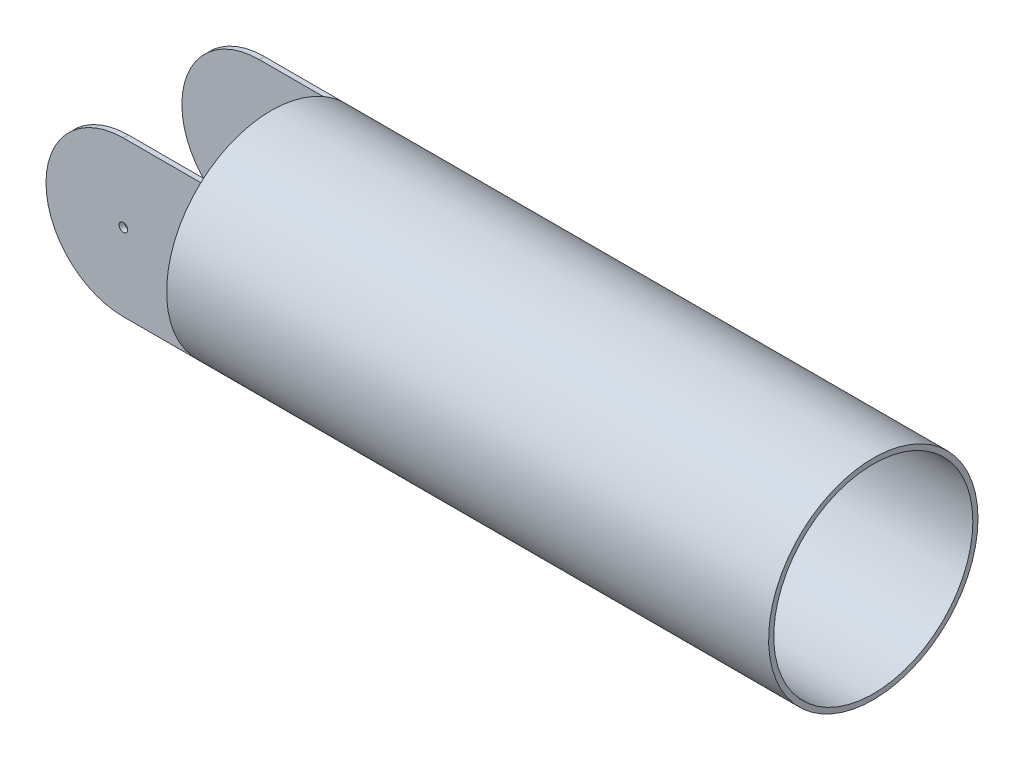
ISO-10303-21;
HEADER;
FILE_DESCRIPTION(('STEP AP214'),'2;1');
FILE_NAME('part.step','',(''),(''),'','','');
FILE_SCHEMA(('AUTOMOTIVE_DESIGN { 1 0 10303 214 1 1 1 1 }'));
ENDSEC;
DATA;
#1=APPLICATION_CONTEXT('core data for automotive mechanical design processes');
#2=APPLICATION_PROTOCOL_DEFINITION('international standard','automotive_design',2000,#1);
#3=PRODUCT_CONTEXT('',#1,'mechanical');
#4=PRODUCT('Part','Part','',(#3));
#5=PRODUCT_RELATED_PRODUCT_CATEGORY('part','',(#4));
#6=PRODUCT_DEFINITION_FORMATION('','',#4);
#7=PRODUCT_DEFINITION_CONTEXT('part definition',#1,'design');
#8=PRODUCT_DEFINITION('design','',#6,#7);
#9=PRODUCT_DEFINITION_SHAPE('','',#8);
#10=(LENGTH_UNIT() NAMED_UNIT(*) SI_UNIT(.MILLI.,.METRE.));
#11=(NAMED_UNIT(*) PLANE_ANGLE_UNIT() SI_UNIT($,.RADIAN.));
#12=(NAMED_UNIT(*) SI_UNIT($,.STERADIAN.) SOLID_ANGLE_UNIT());
#13=UNCERTAINTY_MEASURE_WITH_UNIT(LENGTH_MEASURE(1.E-05),#10,'distance_accuracy_value','');
#14=(GEOMETRIC_REPRESENTATION_CONTEXT(3) GLOBAL_UNCERTAINTY_ASSIGNED_CONTEXT((#13)) GLOBAL_UNIT_ASSIGNED_CONTEXT((#10,
#11,#12)) REPRESENTATION_CONTEXT('',''));
#15=CARTESIAN_POINT('',(0.,0.,0.));
#16=DIRECTION('',(0.,0.,1.));
#17=DIRECTION('',(1.,0.,0.));
#18=AXIS2_PLACEMENT_3D('',#15,#16,#17);
#19=CARTESIAN_POINT('',(0.,0.,164.));
#20=DIRECTION('',(0.,1.,0.));
#21=DIRECTION('',(0.,0.,1.));
#22=AXIS2_PLACEMENT_3D('',#19,#20,#21);
#23=PLANE('',#22);
#24=DIRECTION('',(0.,0.,1.));
#25=VECTOR('',#24,1.);
#26=CARTESIAN_POINT('',(90.,0.,-536.));
#27=LINE('',#26,#25);
#28=CARTESIAN_POINT('',(90.,0.,158.));
#29=VERTEX_POINT('',#28);
#30=CARTESIAN_POINT('',(90.,0.,164.));
#31=VERTEX_POINT('',#30);
#32=EDGE_CURVE('E136',#29,#31,#27,.T.);
#33=ORIENTED_EDGE('',*,*,#32,.F.);
#34=DIRECTION('',(1.,0.,0.));
#35=VECTOR('',#34,1.);
#36=CARTESIAN_POINT('',(0.,0.,158.));
#37=LINE('',#36,#35);
#38=CARTESIAN_POINT('',(180.,0.,158.));
#39=VERTEX_POINT('',#38);
#40=EDGE_CURVE('E144',#29,#39,#37,.T.);
#41=ORIENTED_EDGE('',*,*,#40,.T.);
#42=DIRECTION('',(0.,0.,-1.));
#43=VECTOR('',#42,1.);
#44=CARTESIAN_POINT('',(180.,0.,164.));
#45=LINE('',#44,#43);
#46=CARTESIAN_POINT('',(180.,0.,164.));
#47=VERTEX_POINT('',#46);
#48=EDGE_CURVE('E131',#47,#39,#45,.T.);
#49=ORIENTED_EDGE('',*,*,#48,.F.);
#50=DIRECTION('',(1.,0.,0.));
#51=VECTOR('',#50,1.);
#52=CARTESIAN_POINT('',(0.,0.,164.));
#53=LINE('',#52,#51);
#54=EDGE_CURVE('E152',#31,#47,#53,.T.);
#55=ORIENTED_EDGE('',*,*,#54,.F.);
#56=EDGE_LOOP('',(#33,#41,#49,#55));
#57=FACE_BOUND('',#56,.T.);
#58=ADVANCED_FACE('F33',(#57),#23,.F.);
#59=CARTESIAN_POINT('',(0.,180.,164.));
#60=DIRECTION('',(0.,-1.,0.));
#61=DIRECTION('',(0.,0.,-1.));
#62=AXIS2_PLACEMENT_3D('',#59,#60,#61);
#63=PLANE('',#62);
#64=DIRECTION('',(0.,0.,-1.));
#65=VECTOR('',#64,1.);
#66=CARTESIAN_POINT('',(180.,180.,164.));
#67=LINE('',#66,#65);
#68=CARTESIAN_POINT('',(180.,180.,164.));
#69=VERTEX_POINT('',#68);
#70=CARTESIAN_POINT('',(180.,180.,158.));
#71=VERTEX_POINT('',#70);
#72=EDGE_CURVE('E119',#69,#71,#67,.T.);
#73=ORIENTED_EDGE('',*,*,#72,.T.);
#74=DIRECTION('',(1.,0.,0.));
#75=VECTOR('',#74,1.);
#76=CARTESIAN_POINT('',(180.,180.,158.));
#77=LINE('',#76,#75);
#78=CARTESIAN_POINT('',(90.,180.,158.));
#79=VERTEX_POINT('',#78);
#80=EDGE_CURVE('E105',#79,#71,#77,.T.);
#81=ORIENTED_EDGE('',*,*,#80,.F.);
#82=DIRECTION('',(0.,0.,1.));
#83=VECTOR('',#82,1.);
#84=CARTESIAN_POINT('',(90.,180.,-536.));
#85=LINE('',#84,#83);
#86=CARTESIAN_POINT('',(90.,180.,164.));
#87=VERTEX_POINT('',#86);
#88=EDGE_CURVE('E168',#79,#87,#85,.T.);
#89=ORIENTED_EDGE('',*,*,#88,.T.);
#90=DIRECTION('',(-1.,0.,0.));
#91=VECTOR('',#90,1.);
#92=CARTESIAN_POINT('',(0.,180.,164.));
#93=LINE('',#92,#91);
#94=EDGE_CURVE('E120',#69,#87,#93,.T.);
#95=ORIENTED_EDGE('',*,*,#94,.F.);
#96=EDGE_LOOP('',(#73,#81,#89,#95));
#97=FACE_BOUND('',#96,.T.);
#98=ADVANCED_FACE('F225',(#97),#63,.F.);
#99=CARTESIAN_POINT('',(90.,90.,-536.));
#100=DIRECTION('',(0.,0.,1.));
#101=DIRECTION('',(1.,0.,0.));
#102=AXIS2_PLACEMENT_3D('',#99,#100,#101);
#103=CYLINDRICAL_SURFACE('',#102,90.);
#104=CARTESIAN_POINT('',(90.,90.,158.));
#105=DIRECTION('',(0.,0.,1.));
#106=DIRECTION('',(1.,0.,0.));
#107=AXIS2_PLACEMENT_3D('',#104,#105,#106);
#108=CIRCLE('',#107,90.);
#109=EDGE_CURVE('E11',#29,#79,#108,.F.);
#110=ORIENTED_EDGE('',*,*,#109,.F.);
#111=ORIENTED_EDGE('',*,*,#32,.T.);
#112=CARTESIAN_POINT('',(90.,90.,164.));
#113=DIRECTION('',(0.,0.,1.));
#114=DIRECTION('',(1.,0.,0.));
#115=AXIS2_PLACEMENT_3D('',#112,#113,#114);
#116=CIRCLE('',#115,90.);
#117=EDGE_CURVE('E169',#87,#31,#116,.T.);
#118=ORIENTED_EDGE('',*,*,#117,.F.);
#119=ORIENTED_EDGE('',*,*,#88,.F.);
#120=EDGE_LOOP('',(#110,#111,#118,#119));
#121=FACE_BOUND('',#120,.T.);
#122=ADVANCED_FACE('F230',(#121),#103,.T.);
#123=CARTESIAN_POINT('',(0.,0.,164.));
#124=DIRECTION('',(0.,0.,-1.));
#125=DIRECTION('',(-1.,0.,0.));
#126=AXIS2_PLACEMENT_3D('',#123,#124,#125);
#127=PLANE('',#126);
#128=CARTESIAN_POINT('',(90.,90.,164.));
#129=DIRECTION('',(0.,0.,1.));
#130=DIRECTION('',(1.,0.,0.));
#131=AXIS2_PLACEMENT_3D('',#128,#129,#130);
#132=CIRCLE('',#131,5.00000000000001);
#133=CARTESIAN_POINT('',(95.,90.,164.));
#134=VERTEX_POINT('',#133);
#135=EDGE_CURVE('E182',#134,#134,#132,.T.);
#136=ORIENTED_EDGE('',*,*,#135,.F.);
#137=EDGE_LOOP('',(#136));
#138=FACE_BOUND('',#137,.T.);
#139=ORIENTED_EDGE('',*,*,#117,.T.);
#140=ORIENTED_EDGE('',*,*,#54,.T.);
#141=DIRECTION('',(0.,1.,0.));
#142=VECTOR('',#141,1.);
#143=CARTESIAN_POINT('',(180.,0.,164.));
#144=LINE('',#143,#142);
#145=EDGE_CURVE('E125',#47,#69,#144,.T.);
#146=ORIENTED_EDGE('',*,*,#145,.T.);
#147=ORIENTED_EDGE('',*,*,#94,.T.);
#148=EDGE_LOOP('',(#139,#140,#146,#147));
#149=FACE_BOUND('',#148,.T.);
#150=ADVANCED_FACE('F238',(#138,#149),#127,.F.);
#151=CARTESIAN_POINT('',(0.,0.,0.));
#152=DIRECTION('',(0.,0.,-1.));
#153=DIRECTION('',(-1.,0.,0.));
#154=AXIS2_PLACEMENT_3D('',#151,#152,#153);
#155=PLANE('',#154);
#156=CARTESIAN_POINT('',(90.,90.,0.));
#157=DIRECTION('',(0.,0.,-1.));
#158=DIRECTION('',(-1.,0.,0.));
#159=AXIS2_PLACEMENT_3D('',#156,#157,#158);
#160=CIRCLE('',#159,5.00000000000001);
#161=CARTESIAN_POINT('',(85.,90.,0.));
#162=VERTEX_POINT('',#161);
#163=EDGE_CURVE('E112',#162,#162,#160,.T.);
#164=ORIENTED_EDGE('',*,*,#163,.F.);
#165=EDGE_LOOP('',(#164));
#166=FACE_BOUND('',#165,.T.);
#167=DIRECTION('',(1.,0.,0.));
#168=VECTOR('',#167,1.);
#169=CARTESIAN_POINT('',(0.,0.,0.));
#170=LINE('',#169,#168);
#171=CARTESIAN_POINT('',(90.,0.,0.));
#172=VERTEX_POINT('',#171);
#173=CARTESIAN_POINT('',(180.,0.,0.));
#174=VERTEX_POINT('',#173);
#175=EDGE_CURVE('E151',#172,#174,#170,.T.);
#176=ORIENTED_EDGE('',*,*,#175,.F.);
#177=CARTESIAN_POINT('',(90.,90.,0.));
#178=DIRECTION('',(0.,0.,-1.));
#179=DIRECTION('',(-1.,0.,0.));
#180=AXIS2_PLACEMENT_3D('',#177,#178,#179);
#181=CIRCLE('',#180,90.);
#182=CARTESIAN_POINT('',(90.,180.,0.));
#183=VERTEX_POINT('',#182);
#184=EDGE_CURVE('E134',#172,#183,#181,.T.);
#185=ORIENTED_EDGE('',*,*,#184,.T.);
#186=DIRECTION('',(-1.,0.,0.));
#187=VECTOR('',#186,1.);
#188=CARTESIAN_POINT('',(0.,180.,0.));
#189=LINE('',#188,#187);
#190=CARTESIAN_POINT('',(180.,180.,0.));
#191=VERTEX_POINT('',#190);
#192=EDGE_CURVE('E129',#191,#183,#189,.T.);
#193=ORIENTED_EDGE('',*,*,#192,.F.);
#194=DIRECTION('',(0.,1.,0.));
#195=VECTOR('',#194,1.);
#196=CARTESIAN_POINT('',(180.,0.,0.));
#197=LINE('',#196,#195);
#198=EDGE_CURVE('E153',#174,#191,#197,.T.);
#199=ORIENTED_EDGE('',*,*,#198,.F.);
#200=EDGE_LOOP('',(#176,#185,#193,#199));
#201=FACE_BOUND('',#200,.T.);
#202=ADVANCED_FACE('F148',(#166,#201),#155,.T.);
#203=CARTESIAN_POINT('',(180.,0.,6.));
#204=VERTEX_POINT('',#203);
#205=EDGE_CURVE('E123',#204,#174,#45,.T.);
#206=ORIENTED_EDGE('',*,*,#205,.F.);
#207=DIRECTION('',(-1.,0.,0.));
#208=VECTOR('',#207,1.);
#209=CARTESIAN_POINT('',(0.,0.,6.00000000000003));
#210=LINE('',#209,#208);
#211=CARTESIAN_POINT('',(90.,0.,6.00000000000001));
#212=VERTEX_POINT('',#211);
#213=EDGE_CURVE('E99',#204,#212,#210,.T.);
#214=ORIENTED_EDGE('',*,*,#213,.T.);
#215=EDGE_CURVE('E137',#172,#212,#27,.T.);
#216=ORIENTED_EDGE('',*,*,#215,.F.);
#217=ORIENTED_EDGE('',*,*,#175,.T.);
#218=EDGE_LOOP('',(#206,#214,#216,#217));
#219=FACE_BOUND('',#218,.T.);
#220=ADVANCED_FACE('F35',(#219),#23,.F.);
#221=CARTESIAN_POINT('',(90.,180.,6.00000000000001));
#222=VERTEX_POINT('',#221);
#223=EDGE_CURVE('E56',#183,#222,#85,.T.);
#224=ORIENTED_EDGE('',*,*,#223,.T.);
#225=DIRECTION('',(-1.,0.,0.));
#226=VECTOR('',#225,1.);
#227=CARTESIAN_POINT('',(180.,180.,6.));
#228=LINE('',#227,#226);
#229=CARTESIAN_POINT('',(180.,180.,6.));
#230=VERTEX_POINT('',#229);
#231=EDGE_CURVE('E49',#230,#222,#228,.T.);
#232=ORIENTED_EDGE('',*,*,#231,.F.);
#233=EDGE_CURVE('E110',#230,#191,#67,.T.);
#234=ORIENTED_EDGE('',*,*,#233,.T.);
#235=ORIENTED_EDGE('',*,*,#192,.T.);
#236=EDGE_LOOP('',(#224,#232,#234,#235));
#237=FACE_BOUND('',#236,.T.);
#238=ADVANCED_FACE('F108',(#237),#63,.F.);
#239=CARTESIAN_POINT('',(180.,90.,82.));
#240=DIRECTION('',(1.,0.,0.));
#241=DIRECTION('',(0.,0.,-1.));
#242=AXIS2_PLACEMENT_3D('',#239,#240,#241);
#243=PLANE('',#242);
#244=ORIENTED_EDGE('',*,*,#72,.F.);
#245=CARTESIAN_POINT('',(180.,90.,82.));
#246=DIRECTION('',(1.,0.,0.));
#247=DIRECTION('',(0.,0.,-1.));
#248=AXIS2_PLACEMENT_3D('',#245,#246,#247);
#249=CIRCLE('',#248,121.753850041795);
#250=EDGE_CURVE('E118',#191,#69,#249,.T.);
#251=ORIENTED_EDGE('',*,*,#250,.F.);
#252=ORIENTED_EDGE('',*,*,#233,.F.);
#253=DIRECTION('',(0.,1.,0.));
#254=VECTOR('',#253,1.);
#255=CARTESIAN_POINT('',(180.,-520.,6.));
#256=LINE('',#255,#254);
#257=EDGE_CURVE('E96',#204,#230,#256,.T.);
#258=ORIENTED_EDGE('',*,*,#257,.F.);
#259=ORIENTED_EDGE('',*,*,#205,.T.);
#260=EDGE_CURVE('E215',#47,#174,#249,.T.);
#261=ORIENTED_EDGE('',*,*,#260,.F.);
#262=ORIENTED_EDGE('',*,*,#48,.T.);
#263=DIRECTION('',(0.,1.,0.));
#264=VECTOR('',#263,1.);
#265=CARTESIAN_POINT('',(180.,-520.,158.));
#266=LINE('',#265,#264);
#267=EDGE_CURVE('E104',#39,#71,#266,.T.);
#268=ORIENTED_EDGE('',*,*,#267,.T.);
#269=EDGE_LOOP('',(#244,#251,#252,#258,#259,#261,#262,#268));
#270=FACE_BOUND('',#269,.T.);
#271=ADVANCED_FACE('F116',(#270),#243,.F.);
#272=ORIENTED_EDGE('',*,*,#145,.F.);
#273=EDGE_CURVE('E163',#69,#47,#249,.T.);
#274=ORIENTED_EDGE('',*,*,#273,.F.);
#275=EDGE_LOOP('',(#272,#274));
#276=FACE_BOUND('',#275,.T.);
#277=ADVANCED_FACE('F217',(#276),#243,.F.);
#278=EDGE_CURVE('E164',#174,#191,#249,.T.);
#279=ORIENTED_EDGE('',*,*,#278,.F.);
#280=ORIENTED_EDGE('',*,*,#198,.T.);
#281=EDGE_LOOP('',(#279,#280));
#282=FACE_BOUND('',#281,.T.);
#283=ADVANCED_FACE('F210',(#282),#243,.F.);
#284=CARTESIAN_POINT('',(880.,90.,82.));
#285=DIRECTION('',(-1.,0.,0.));
#286=DIRECTION('',(0.,0.,1.));
#287=AXIS2_PLACEMENT_3D('',#284,#285,#286);
#288=CYLINDRICAL_SURFACE('',#287,121.753850041795);
#289=CARTESIAN_POINT('',(880.,90.,82.));
#290=DIRECTION('',(1.,0.,0.));
#291=DIRECTION('',(0.,0.,-1.));
#292=AXIS2_PLACEMENT_3D('',#289,#290,#291);
#293=CIRCLE('',#292,121.753850041795);
#294=CARTESIAN_POINT('',(880.,90.,-39.7538500417954));
#295=VERTEX_POINT('',#294);
#296=EDGE_CURVE('E158',#295,#295,#293,.T.);
#297=ORIENTED_EDGE('',*,*,#296,.F.);
#298=EDGE_LOOP('',(#297));
#299=FACE_BOUND('',#298,.T.);
#300=ORIENTED_EDGE('',*,*,#250,.T.);
#301=ORIENTED_EDGE('',*,*,#273,.T.);
#302=ORIENTED_EDGE('',*,*,#260,.T.);
#303=ORIENTED_EDGE('',*,*,#278,.T.);
#304=EDGE_LOOP('',(#300,#301,#302,#303));
#305=FACE_BOUND('',#304,.T.);
#306=ADVANCED_FACE('F204',(#299,#305),#288,.T.);
#307=CARTESIAN_POINT('',(880.,90.,82.));
#308=DIRECTION('',(1.,0.,0.));
#309=DIRECTION('',(0.,0.,-1.));
#310=AXIS2_PLACEMENT_3D('',#307,#308,#309);
#311=PLANE('',#310);
#312=CARTESIAN_POINT('',(880.,90.,82.));
#313=DIRECTION('',(1.,0.,0.));
#314=DIRECTION('',(0.,0.,-1.));
#315=AXIS2_PLACEMENT_3D('',#312,#313,#314);
#316=CIRCLE('',#315,115.753850041795);
#317=CARTESIAN_POINT('',(880.,90.,-33.7538500417954));
#318=VERTEX_POINT('',#317);
#319=EDGE_CURVE('E186',#318,#318,#316,.T.);
#320=ORIENTED_EDGE('',*,*,#319,.F.);
#321=EDGE_LOOP('',(#320));
#322=FACE_BOUND('',#321,.T.);
#323=ORIENTED_EDGE('',*,*,#296,.T.);
#324=EDGE_LOOP('',(#323));
#325=FACE_BOUND('',#324,.T.);
#326=ADVANCED_FACE('F201',(#322,#325),#311,.T.);
#327=ORIENTED_EDGE('',*,*,#215,.T.);
#328=CARTESIAN_POINT('',(90.,90.,6.00000000000001));
#329=DIRECTION('',(0.,0.,-1.));
#330=DIRECTION('',(-1.,0.,0.));
#331=AXIS2_PLACEMENT_3D('',#328,#329,#330);
#332=CIRCLE('',#331,90.);
#333=EDGE_CURVE('E42',#222,#212,#332,.F.);
#334=ORIENTED_EDGE('',*,*,#333,.F.);
#335=ORIENTED_EDGE('',*,*,#223,.F.);
#336=ORIENTED_EDGE('',*,*,#184,.F.);
#337=EDGE_LOOP('',(#327,#334,#335,#336));
#338=FACE_BOUND('',#337,.T.);
#339=ADVANCED_FACE('F146',(#338),#103,.T.);
#340=CARTESIAN_POINT('',(180.,-520.,158.));
#341=DIRECTION('',(0.,0.,1.));
#342=DIRECTION('',(1.,0.,0.));
#343=AXIS2_PLACEMENT_3D('',#340,#341,#342);
#344=PLANE('',#343);
#345=CARTESIAN_POINT('',(90.,90.,158.));
#346=DIRECTION('',(0.,0.,1.));
#347=DIRECTION('',(1.,0.,0.));
#348=AXIS2_PLACEMENT_3D('',#345,#346,#347);
#349=CIRCLE('',#348,5.00000000000001);
#350=CARTESIAN_POINT('',(95.,90.,158.));
#351=VERTEX_POINT('',#350);
#352=EDGE_CURVE('E179',#351,#351,#349,.T.);
#353=ORIENTED_EDGE('',*,*,#352,.T.);
#354=EDGE_LOOP('',(#353));
#355=FACE_BOUND('',#354,.T.);
#356=ORIENTED_EDGE('',*,*,#40,.F.);
#357=ORIENTED_EDGE('',*,*,#109,.T.);
#358=ORIENTED_EDGE('',*,*,#80,.T.);
#359=ORIENTED_EDGE('',*,*,#267,.F.);
#360=EDGE_LOOP('',(#356,#357,#358,#359));
#361=FACE_BOUND('',#360,.T.);
#362=ADVANCED_FACE('F256',(#355,#361),#344,.F.);
#363=CARTESIAN_POINT('',(180.,-520.,6.));
#364=DIRECTION('',(0.,0.,-1.));
#365=DIRECTION('',(-1.,0.,0.));
#366=AXIS2_PLACEMENT_3D('',#363,#364,#365);
#367=PLANE('',#366);
#368=CARTESIAN_POINT('',(90.,90.,6.00000000000001));
#369=DIRECTION('',(0.,0.,-1.));
#370=DIRECTION('',(-1.,0.,0.));
#371=AXIS2_PLACEMENT_3D('',#368,#369,#370);
#372=CIRCLE('',#371,5.00000000000001);
#373=CARTESIAN_POINT('',(85.,90.,6.00000000000001));
#374=VERTEX_POINT('',#373);
#375=EDGE_CURVE('E37',#374,#374,#372,.T.);
#376=ORIENTED_EDGE('',*,*,#375,.T.);
#377=EDGE_LOOP('',(#376));
#378=FACE_BOUND('',#377,.T.);
#379=ORIENTED_EDGE('',*,*,#257,.T.);
#380=ORIENTED_EDGE('',*,*,#231,.T.);
#381=ORIENTED_EDGE('',*,*,#333,.T.);
#382=ORIENTED_EDGE('',*,*,#213,.F.);
#383=EDGE_LOOP('',(#379,#380,#381,#382));
#384=FACE_BOUND('',#383,.T.);
#385=ADVANCED_FACE('F97',(#378,#384),#367,.F.);
#386=CARTESIAN_POINT('',(90.,90.,-536.));
#387=DIRECTION('',(0.,0.,1.));
#388=DIRECTION('',(1.,0.,0.));
#389=AXIS2_PLACEMENT_3D('',#386,#387,#388);
#390=CYLINDRICAL_SURFACE('',#389,5.00000000000001);
#391=ORIENTED_EDGE('',*,*,#163,.T.);
#392=EDGE_LOOP('',(#391));
#393=FACE_BOUND('',#392,.T.);
#394=ORIENTED_EDGE('',*,*,#375,.F.);
#395=EDGE_LOOP('',(#394));
#396=FACE_BOUND('',#395,.T.);
#397=ADVANCED_FACE('F248',(#393,#396),#390,.F.);
#398=ORIENTED_EDGE('',*,*,#135,.T.);
#399=EDGE_LOOP('',(#398));
#400=FACE_BOUND('',#399,.T.);
#401=ORIENTED_EDGE('',*,*,#352,.F.);
#402=EDGE_LOOP('',(#401));
#403=FACE_BOUND('',#402,.T.);
#404=ADVANCED_FACE('F197',(#400,#403),#390,.F.);
#405=CARTESIAN_POINT('',(186.,90.,82.));
#406=DIRECTION('',(1.,0.,0.));
#407=DIRECTION('',(0.,0.,-1.));
#408=AXIS2_PLACEMENT_3D('',#405,#406,#407);
#409=CYLINDRICAL_SURFACE('',#408,115.753850041795);
#410=CARTESIAN_POINT('',(186.,90.,82.));
#411=DIRECTION('',(1.,0.,0.));
#412=DIRECTION('',(0.,0.,-1.));
#413=AXIS2_PLACEMENT_3D('',#410,#411,#412);
#414=CIRCLE('',#413,115.753850041795);
#415=CARTESIAN_POINT('',(186.,90.,-33.7538500417954));
#416=VERTEX_POINT('',#415);
#417=EDGE_CURVE('E185',#416,#416,#414,.T.);
#418=ORIENTED_EDGE('',*,*,#417,.F.);
#419=EDGE_LOOP('',(#418));
#420=FACE_BOUND('',#419,.T.);
#421=ORIENTED_EDGE('',*,*,#319,.T.);
#422=EDGE_LOOP('',(#421));
#423=FACE_BOUND('',#422,.T.);
#424=ADVANCED_FACE('F194',(#420,#423),#409,.F.);
#425=CARTESIAN_POINT('',(186.,90.,82.));
#426=DIRECTION('',(1.,0.,0.));
#427=DIRECTION('',(0.,0.,-1.));
#428=AXIS2_PLACEMENT_3D('',#425,#426,#427);
#429=PLANE('',#428);
#430=ORIENTED_EDGE('',*,*,#417,.T.);
#431=EDGE_LOOP('',(#430));
#432=FACE_BOUND('',#431,.T.);
#433=ADVANCED_FACE('F192',(#432),#429,.T.);
#434=CLOSED_SHELL('',(#58,#98,#122,#150,#202,#220,#238,#271,#277,#283,#306,#326,#339,#362,#385,
#397,#404,#424,#433));
#435=MANIFOLD_SOLID_BREP('B2',#434);
#436=ADVANCED_BREP_SHAPE_REPRESENTATION('',(#18,#435),#14);
#437=SHAPE_DEFINITION_REPRESENTATION(#9,#436);
ENDSEC;
END-ISO-10303-21;
